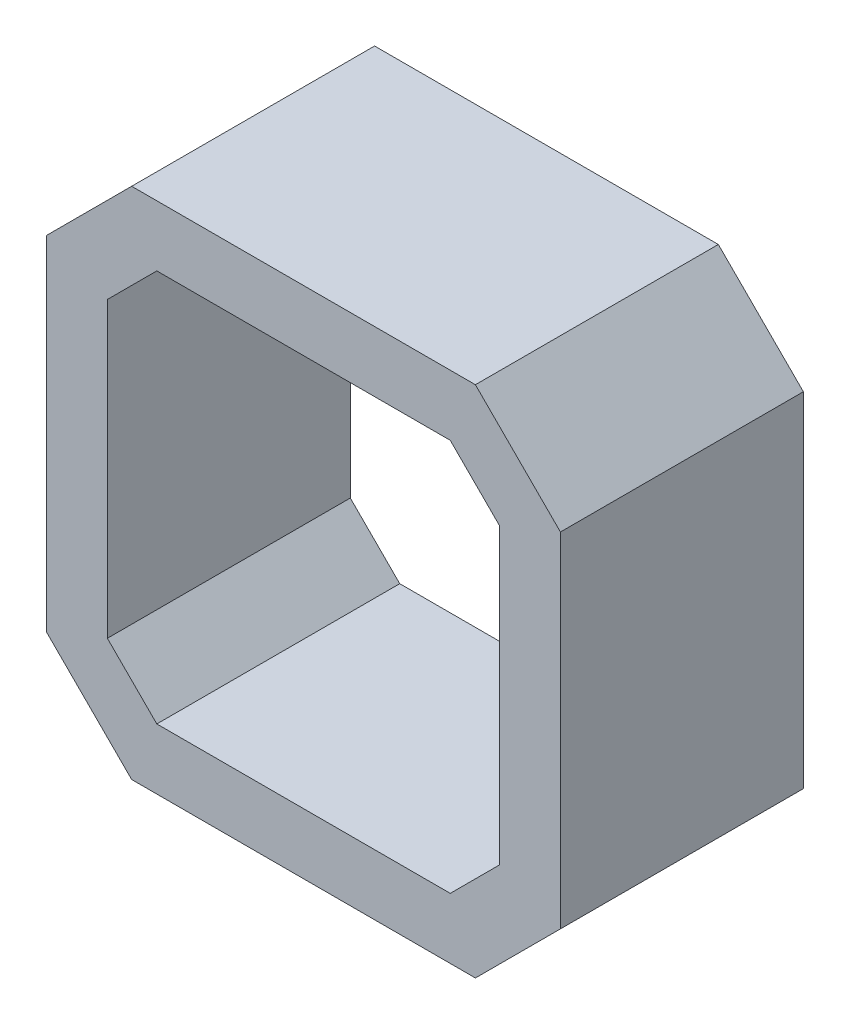
ISO-10303-21;
HEADER;
FILE_DESCRIPTION(('STEP AP214'),'2;1');
FILE_NAME('part.step','',(''),(''),'','','');
FILE_SCHEMA(('AUTOMOTIVE_DESIGN { 1 0 10303 214 1 1 1 1 }'));
ENDSEC;
DATA;
#1=APPLICATION_CONTEXT('core data for automotive mechanical design processes');
#2=APPLICATION_PROTOCOL_DEFINITION('international standard','automotive_design',2000,#1);
#3=PRODUCT_CONTEXT('',#1,'mechanical');
#4=PRODUCT('Part','Part','',(#3));
#5=PRODUCT_RELATED_PRODUCT_CATEGORY('part','',(#4));
#6=PRODUCT_DEFINITION_FORMATION('','',#4);
#7=PRODUCT_DEFINITION_CONTEXT('part definition',#1,'design');
#8=PRODUCT_DEFINITION('design','',#6,#7);
#9=PRODUCT_DEFINITION_SHAPE('','',#8);
#10=(LENGTH_UNIT() NAMED_UNIT(*) SI_UNIT(.MILLI.,.METRE.));
#11=(NAMED_UNIT(*) PLANE_ANGLE_UNIT() SI_UNIT($,.RADIAN.));
#12=(NAMED_UNIT(*) SI_UNIT($,.STERADIAN.) SOLID_ANGLE_UNIT());
#13=UNCERTAINTY_MEASURE_WITH_UNIT(LENGTH_MEASURE(1.E-05),#10,'distance_accuracy_value','');
#14=(GEOMETRIC_REPRESENTATION_CONTEXT(3) GLOBAL_UNCERTAINTY_ASSIGNED_CONTEXT((#13)) GLOBAL_UNIT_ASSIGNED_CONTEXT((#10,
#11,#12)) REPRESENTATION_CONTEXT('',''));
#15=CARTESIAN_POINT('',(0.,0.,0.));
#16=DIRECTION('',(0.,0.,1.));
#17=DIRECTION('',(1.,0.,0.));
#18=AXIS2_PLACEMENT_3D('',#15,#16,#17);
#19=CARTESIAN_POINT('',(0.,0.,20.));
#20=DIRECTION('',(0.,0.,-1.));
#21=DIRECTION('',(-1.,0.,0.));
#22=AXIS2_PLACEMENT_3D('',#19,#20,#21);
#23=PLANE('',#22);
#24=DIRECTION('',(0.,-1.,0.));
#25=VECTOR('',#24,1.);
#26=CARTESIAN_POINT('',(-21.15,-14.15,20.));
#27=LINE('',#26,#25);
#28=CARTESIAN_POINT('',(-21.15,14.15,20.));
#29=VERTEX_POINT('',#28);
#30=CARTESIAN_POINT('',(-21.15,-14.15,20.));
#31=VERTEX_POINT('',#30);
#32=EDGE_CURVE('E211',#29,#31,#27,.T.);
#33=ORIENTED_EDGE('',*,*,#32,.T.);
#34=DIRECTION('',(0.707106781186547,-0.707106781186547,0.));
#35=VECTOR('',#34,1.);
#36=CARTESIAN_POINT('',(-21.15,-14.15,20.));
#37=LINE('',#36,#35);
#38=CARTESIAN_POINT('',(-14.15,-21.15,20.));
#39=VERTEX_POINT('',#38);
#40=EDGE_CURVE('E214',#31,#39,#37,.T.);
#41=ORIENTED_EDGE('',*,*,#40,.T.);
#42=DIRECTION('',(1.,0.,0.));
#43=VECTOR('',#42,1.);
#44=CARTESIAN_POINT('',(-14.15,-21.15,20.));
#45=LINE('',#44,#43);
#46=CARTESIAN_POINT('',(14.15,-21.15,20.));
#47=VERTEX_POINT('',#46);
#48=EDGE_CURVE('E217',#39,#47,#45,.T.);
#49=ORIENTED_EDGE('',*,*,#48,.T.);
#50=DIRECTION('',(0.707106781186547,0.707106781186547,0.));
#51=VECTOR('',#50,1.);
#52=CARTESIAN_POINT('',(14.15,-21.15,20.));
#53=LINE('',#52,#51);
#54=CARTESIAN_POINT('',(21.15,-14.15,20.));
#55=VERTEX_POINT('',#54);
#56=EDGE_CURVE('E219',#47,#55,#53,.T.);
#57=ORIENTED_EDGE('',*,*,#56,.T.);
#58=DIRECTION('',(0.,1.,0.));
#59=VECTOR('',#58,1.);
#60=CARTESIAN_POINT('',(21.15,-14.15,20.));
#61=LINE('',#60,#59);
#62=CARTESIAN_POINT('',(21.15,14.15,20.));
#63=VERTEX_POINT('',#62);
#64=EDGE_CURVE('E221',#55,#63,#61,.T.);
#65=ORIENTED_EDGE('',*,*,#64,.T.);
#66=DIRECTION('',(-0.707106781186547,0.707106781186547,0.));
#67=VECTOR('',#66,1.);
#68=CARTESIAN_POINT('',(14.15,21.15,20.));
#69=LINE('',#68,#67);
#70=CARTESIAN_POINT('',(14.15,21.15,20.));
#71=VERTEX_POINT('',#70);
#72=EDGE_CURVE('E223',#63,#71,#69,.T.);
#73=ORIENTED_EDGE('',*,*,#72,.T.);
#74=DIRECTION('',(-1.,0.,0.));
#75=VECTOR('',#74,1.);
#76=CARTESIAN_POINT('',(-14.15,21.15,20.));
#77=LINE('',#76,#75);
#78=CARTESIAN_POINT('',(-14.15,21.15,20.));
#79=VERTEX_POINT('',#78);
#80=EDGE_CURVE('E225',#71,#79,#77,.T.);
#81=ORIENTED_EDGE('',*,*,#80,.T.);
#82=DIRECTION('',(-0.707106781186547,-0.707106781186547,0.));
#83=VECTOR('',#82,1.);
#84=CARTESIAN_POINT('',(-21.15,14.15,20.));
#85=LINE('',#84,#83);
#86=EDGE_CURVE('E227',#79,#29,#85,.T.);
#87=ORIENTED_EDGE('',*,*,#86,.T.);
#88=EDGE_LOOP('',(#33,#41,#49,#57,#65,#73,#81,#87));
#89=FACE_BOUND('',#88,.T.);
#90=DIRECTION('',(-0.707106781186547,-0.707106781186547,0.));
#91=VECTOR('',#90,1.);
#92=CARTESIAN_POINT('',(-16.15,12.0789321881345,20.));
#93=LINE('',#92,#91);
#94=CARTESIAN_POINT('',(-12.0789321881345,16.15,20.));
#95=VERTEX_POINT('',#94);
#96=CARTESIAN_POINT('',(-16.15,12.0789321881345,20.));
#97=VERTEX_POINT('',#96);
#98=EDGE_CURVE('E146',#95,#97,#93,.T.);
#99=ORIENTED_EDGE('',*,*,#98,.F.);
#100=DIRECTION('',(-1.,0.,0.));
#101=VECTOR('',#100,1.);
#102=CARTESIAN_POINT('',(-12.0789321881345,16.15,20.));
#103=LINE('',#102,#101);
#104=CARTESIAN_POINT('',(12.0789321881345,16.15,20.));
#105=VERTEX_POINT('',#104);
#106=EDGE_CURVE('E179',#105,#95,#103,.T.);
#107=ORIENTED_EDGE('',*,*,#106,.F.);
#108=DIRECTION('',(-0.707106781186547,0.707106781186547,0.));
#109=VECTOR('',#108,1.);
#110=CARTESIAN_POINT('',(12.0789321881345,16.15,20.));
#111=LINE('',#110,#109);
#112=CARTESIAN_POINT('',(16.15,12.0789321881345,20.));
#113=VERTEX_POINT('',#112);
#114=EDGE_CURVE('E177',#113,#105,#111,.T.);
#115=ORIENTED_EDGE('',*,*,#114,.F.);
#116=DIRECTION('',(0.,1.,0.));
#117=VECTOR('',#116,1.);
#118=CARTESIAN_POINT('',(16.15,-12.0789321881345,20.));
#119=LINE('',#118,#117);
#120=CARTESIAN_POINT('',(16.15,-12.0789321881345,20.));
#121=VERTEX_POINT('',#120);
#122=EDGE_CURVE('E175',#121,#113,#119,.T.);
#123=ORIENTED_EDGE('',*,*,#122,.F.);
#124=DIRECTION('',(0.707106781186547,0.707106781186547,0.));
#125=VECTOR('',#124,1.);
#126=CARTESIAN_POINT('',(12.0789321881345,-16.15,20.));
#127=LINE('',#126,#125);
#128=CARTESIAN_POINT('',(12.0789321881345,-16.15,20.));
#129=VERTEX_POINT('',#128);
#130=EDGE_CURVE('E173',#129,#121,#127,.T.);
#131=ORIENTED_EDGE('',*,*,#130,.F.);
#132=DIRECTION('',(1.,0.,0.));
#133=VECTOR('',#132,1.);
#134=CARTESIAN_POINT('',(-12.0789321881345,-16.15,20.));
#135=LINE('',#134,#133);
#136=CARTESIAN_POINT('',(-12.0789321881345,-16.15,20.));
#137=VERTEX_POINT('',#136);
#138=EDGE_CURVE('E169',#137,#129,#135,.T.);
#139=ORIENTED_EDGE('',*,*,#138,.F.);
#140=DIRECTION('',(0.707106781186547,-0.707106781186547,0.));
#141=VECTOR('',#140,1.);
#142=CARTESIAN_POINT('',(-16.15,-12.0789321881345,20.));
#143=LINE('',#142,#141);
#144=CARTESIAN_POINT('',(-16.15,-12.0789321881345,20.));
#145=VERTEX_POINT('',#144);
#146=EDGE_CURVE('E167',#145,#137,#143,.T.);
#147=ORIENTED_EDGE('',*,*,#146,.F.);
#148=DIRECTION('',(0.,-1.,0.));
#149=VECTOR('',#148,1.);
#150=CARTESIAN_POINT('',(-16.15,-12.0789321881345,20.));
#151=LINE('',#150,#149);
#152=EDGE_CURVE('E154',#97,#145,#151,.T.);
#153=ORIENTED_EDGE('',*,*,#152,.F.);
#154=EDGE_LOOP('',(#99,#107,#115,#123,#131,#139,#147,#153));
#155=FACE_BOUND('',#154,.T.);
#156=ADVANCED_FACE('F33',(#89,#155),#23,.F.);
#157=CARTESIAN_POINT('',(0.,0.,0.));
#158=DIRECTION('',(0.,0.,-1.));
#159=DIRECTION('',(-1.,0.,0.));
#160=AXIS2_PLACEMENT_3D('',#157,#158,#159);
#161=PLANE('',#160);
#162=DIRECTION('',(0.,-1.,0.));
#163=VECTOR('',#162,1.);
#164=CARTESIAN_POINT('',(-21.15,-14.15,0.));
#165=LINE('',#164,#163);
#166=CARTESIAN_POINT('',(-21.15,14.15,0.));
#167=VERTEX_POINT('',#166);
#168=CARTESIAN_POINT('',(-21.15,-14.15,0.));
#169=VERTEX_POINT('',#168);
#170=EDGE_CURVE('E162',#167,#169,#165,.T.);
#171=ORIENTED_EDGE('',*,*,#170,.F.);
#172=DIRECTION('',(-0.707106781186547,-0.707106781186547,0.));
#173=VECTOR('',#172,1.);
#174=CARTESIAN_POINT('',(-21.15,14.15,0.));
#175=LINE('',#174,#173);
#176=CARTESIAN_POINT('',(-14.15,21.15,0.));
#177=VERTEX_POINT('',#176);
#178=EDGE_CURVE('E215',#177,#167,#175,.T.);
#179=ORIENTED_EDGE('',*,*,#178,.F.);
#180=DIRECTION('',(-1.,0.,0.));
#181=VECTOR('',#180,1.);
#182=CARTESIAN_POINT('',(-14.15,21.15,0.));
#183=LINE('',#182,#181);
#184=CARTESIAN_POINT('',(14.15,21.15,0.));
#185=VERTEX_POINT('',#184);
#186=EDGE_CURVE('E242',#185,#177,#183,.T.);
#187=ORIENTED_EDGE('',*,*,#186,.F.);
#188=DIRECTION('',(-0.707106781186547,0.707106781186547,0.));
#189=VECTOR('',#188,1.);
#190=CARTESIAN_POINT('',(14.15,21.15,0.));
#191=LINE('',#190,#189);
#192=CARTESIAN_POINT('',(21.15,14.15,0.));
#193=VERTEX_POINT('',#192);
#194=EDGE_CURVE('E240',#193,#185,#191,.T.);
#195=ORIENTED_EDGE('',*,*,#194,.F.);
#196=DIRECTION('',(0.,1.,0.));
#197=VECTOR('',#196,1.);
#198=CARTESIAN_POINT('',(21.15,-14.15,0.));
#199=LINE('',#198,#197);
#200=CARTESIAN_POINT('',(21.15,-14.15,0.));
#201=VERTEX_POINT('',#200);
#202=EDGE_CURVE('E238',#201,#193,#199,.T.);
#203=ORIENTED_EDGE('',*,*,#202,.F.);
#204=DIRECTION('',(0.707106781186547,0.707106781186547,0.));
#205=VECTOR('',#204,1.);
#206=CARTESIAN_POINT('',(14.15,-21.15,0.));
#207=LINE('',#206,#205);
#208=CARTESIAN_POINT('',(14.15,-21.15,0.));
#209=VERTEX_POINT('',#208);
#210=EDGE_CURVE('E236',#209,#201,#207,.T.);
#211=ORIENTED_EDGE('',*,*,#210,.F.);
#212=DIRECTION('',(1.,0.,0.));
#213=VECTOR('',#212,1.);
#214=CARTESIAN_POINT('',(-14.15,-21.15,0.));
#215=LINE('',#214,#213);
#216=CARTESIAN_POINT('',(-14.15,-21.15,0.));
#217=VERTEX_POINT('',#216);
#218=EDGE_CURVE('E234',#217,#209,#215,.T.);
#219=ORIENTED_EDGE('',*,*,#218,.F.);
#220=DIRECTION('',(0.707106781186547,-0.707106781186547,0.));
#221=VECTOR('',#220,1.);
#222=CARTESIAN_POINT('',(-21.15,-14.15,0.));
#223=LINE('',#222,#221);
#224=EDGE_CURVE('E232',#169,#217,#223,.T.);
#225=ORIENTED_EDGE('',*,*,#224,.F.);
#226=EDGE_LOOP('',(#171,#179,#187,#195,#203,#211,#219,#225));
#227=FACE_BOUND('',#226,.T.);
#228=DIRECTION('',(-1.,0.,0.));
#229=VECTOR('',#228,1.);
#230=CARTESIAN_POINT('',(-12.0789321881345,16.15,0.));
#231=LINE('',#230,#229);
#232=CARTESIAN_POINT('',(12.0789321881345,16.15,0.));
#233=VERTEX_POINT('',#232);
#234=CARTESIAN_POINT('',(-12.0789321881345,16.15,0.));
#235=VERTEX_POINT('',#234);
#236=EDGE_CURVE('E155',#233,#235,#231,.T.);
#237=ORIENTED_EDGE('',*,*,#236,.T.);
#238=DIRECTION('',(-0.707106781186547,-0.707106781186547,0.));
#239=VECTOR('',#238,1.);
#240=CARTESIAN_POINT('',(-16.15,12.0789321881345,0.));
#241=LINE('',#240,#239);
#242=CARTESIAN_POINT('',(-16.15,12.0789321881345,0.));
#243=VERTEX_POINT('',#242);
#244=EDGE_CURVE('E56',#235,#243,#241,.T.);
#245=ORIENTED_EDGE('',*,*,#244,.T.);
#246=DIRECTION('',(0.,-1.,0.));
#247=VECTOR('',#246,1.);
#248=CARTESIAN_POINT('',(-16.15,-12.0789321881345,0.));
#249=LINE('',#248,#247);
#250=CARTESIAN_POINT('',(-16.15,-12.0789321881345,0.));
#251=VERTEX_POINT('',#250);
#252=EDGE_CURVE('E161',#243,#251,#249,.T.);
#253=ORIENTED_EDGE('',*,*,#252,.T.);
#254=DIRECTION('',(0.707106781186547,-0.707106781186547,0.));
#255=VECTOR('',#254,1.);
#256=CARTESIAN_POINT('',(-16.15,-12.0789321881345,0.));
#257=LINE('',#256,#255);
#258=CARTESIAN_POINT('',(-12.0789321881345,-16.15,0.));
#259=VERTEX_POINT('',#258);
#260=EDGE_CURVE('E183',#251,#259,#257,.T.);
#261=ORIENTED_EDGE('',*,*,#260,.T.);
#262=DIRECTION('',(1.,0.,0.));
#263=VECTOR('',#262,1.);
#264=CARTESIAN_POINT('',(-12.0789321881345,-16.15,0.));
#265=LINE('',#264,#263);
#266=CARTESIAN_POINT('',(12.0789321881345,-16.15,0.));
#267=VERTEX_POINT('',#266);
#268=EDGE_CURVE('E186',#259,#267,#265,.T.);
#269=ORIENTED_EDGE('',*,*,#268,.T.);
#270=DIRECTION('',(0.707106781186547,0.707106781186547,0.));
#271=VECTOR('',#270,1.);
#272=CARTESIAN_POINT('',(12.0789321881345,-16.15,0.));
#273=LINE('',#272,#271);
#274=CARTESIAN_POINT('',(16.15,-12.0789321881345,0.));
#275=VERTEX_POINT('',#274);
#276=EDGE_CURVE('E189',#267,#275,#273,.T.);
#277=ORIENTED_EDGE('',*,*,#276,.T.);
#278=DIRECTION('',(0.,1.,0.));
#279=VECTOR('',#278,1.);
#280=CARTESIAN_POINT('',(16.15,-12.0789321881345,0.));
#281=LINE('',#280,#279);
#282=CARTESIAN_POINT('',(16.15,12.0789321881345,0.));
#283=VERTEX_POINT('',#282);
#284=EDGE_CURVE('E192',#275,#283,#281,.T.);
#285=ORIENTED_EDGE('',*,*,#284,.T.);
#286=DIRECTION('',(-0.707106781186547,0.707106781186547,0.));
#287=VECTOR('',#286,1.);
#288=CARTESIAN_POINT('',(12.0789321881345,16.15,0.));
#289=LINE('',#288,#287);
#290=EDGE_CURVE('E195',#283,#233,#289,.T.);
#291=ORIENTED_EDGE('',*,*,#290,.T.);
#292=EDGE_LOOP('',(#237,#245,#253,#261,#269,#277,#285,#291));
#293=FACE_BOUND('',#292,.T.);
#294=ADVANCED_FACE('F272',(#227,#293),#161,.T.);
#295=CARTESIAN_POINT('',(-21.15,-14.15,20.));
#296=DIRECTION('',(1.,0.,0.));
#297=DIRECTION('',(0.,0.,-1.));
#298=AXIS2_PLACEMENT_3D('',#295,#296,#297);
#299=PLANE('',#298);
#300=ORIENTED_EDGE('',*,*,#170,.T.);
#301=DIRECTION('',(0.,0.,-1.));
#302=VECTOR('',#301,1.);
#303=CARTESIAN_POINT('',(-21.15,-14.15,20.));
#304=LINE('',#303,#302);
#305=EDGE_CURVE('E11',#31,#169,#304,.T.);
#306=ORIENTED_EDGE('',*,*,#305,.F.);
#307=ORIENTED_EDGE('',*,*,#32,.F.);
#308=DIRECTION('',(0.,0.,-1.));
#309=VECTOR('',#308,1.);
#310=CARTESIAN_POINT('',(-21.15,14.15,20.));
#311=LINE('',#310,#309);
#312=EDGE_CURVE('E229',#29,#167,#311,.T.);
#313=ORIENTED_EDGE('',*,*,#312,.T.);
#314=EDGE_LOOP('',(#300,#306,#307,#313));
#315=FACE_BOUND('',#314,.T.);
#316=ADVANCED_FACE('F35',(#315),#299,.F.);
#317=CARTESIAN_POINT('',(-21.15,-14.15,20.));
#318=DIRECTION('',(0.707106781186548,0.707106781186548,0.));
#319=DIRECTION('',(-0.707106781186548,0.707106781186548,0.));
#320=AXIS2_PLACEMENT_3D('',#317,#318,#319);
#321=PLANE('',#320);
#322=ORIENTED_EDGE('',*,*,#224,.T.);
#323=DIRECTION('',(0.,0.,-1.));
#324=VECTOR('',#323,1.);
#325=CARTESIAN_POINT('',(-14.15,-21.15,20.));
#326=LINE('',#325,#324);
#327=EDGE_CURVE('E41',#39,#217,#326,.T.);
#328=ORIENTED_EDGE('',*,*,#327,.F.);
#329=ORIENTED_EDGE('',*,*,#40,.F.);
#330=ORIENTED_EDGE('',*,*,#305,.T.);
#331=EDGE_LOOP('',(#322,#328,#329,#330));
#332=FACE_BOUND('',#331,.T.);
#333=ADVANCED_FACE('F289',(#332),#321,.F.);
#334=CARTESIAN_POINT('',(-14.15,-21.15,20.));
#335=DIRECTION('',(0.,1.,0.));
#336=DIRECTION('',(0.,0.,1.));
#337=AXIS2_PLACEMENT_3D('',#334,#335,#336);
#338=PLANE('',#337);
#339=ORIENTED_EDGE('',*,*,#218,.T.);
#340=DIRECTION('',(0.,0.,-1.));
#341=VECTOR('',#340,1.);
#342=CARTESIAN_POINT('',(14.15,-21.15,20.));
#343=LINE('',#342,#341);
#344=EDGE_CURVE('E259',#47,#209,#343,.T.);
#345=ORIENTED_EDGE('',*,*,#344,.F.);
#346=ORIENTED_EDGE('',*,*,#48,.F.);
#347=ORIENTED_EDGE('',*,*,#327,.T.);
#348=EDGE_LOOP('',(#339,#345,#346,#347));
#349=FACE_BOUND('',#348,.T.);
#350=ADVANCED_FACE('F266',(#349),#338,.F.);
#351=CARTESIAN_POINT('',(14.15,-21.15,20.));
#352=DIRECTION('',(-0.707106781186548,0.707106781186548,0.));
#353=DIRECTION('',(-0.707106781186548,-0.707106781186548,0.));
#354=AXIS2_PLACEMENT_3D('',#351,#352,#353);
#355=PLANE('',#354);
#356=ORIENTED_EDGE('',*,*,#210,.T.);
#357=DIRECTION('',(0.,0.,-1.));
#358=VECTOR('',#357,1.);
#359=CARTESIAN_POINT('',(21.15,-14.15,20.));
#360=LINE('',#359,#358);
#361=EDGE_CURVE('E256',#55,#201,#360,.T.);
#362=ORIENTED_EDGE('',*,*,#361,.F.);
#363=ORIENTED_EDGE('',*,*,#56,.F.);
#364=ORIENTED_EDGE('',*,*,#344,.T.);
#365=EDGE_LOOP('',(#356,#362,#363,#364));
#366=FACE_BOUND('',#365,.T.);
#367=ADVANCED_FACE('F278',(#366),#355,.F.);
#368=CARTESIAN_POINT('',(21.15,-14.15,20.));
#369=DIRECTION('',(-1.,0.,0.));
#370=DIRECTION('',(0.,0.,1.));
#371=AXIS2_PLACEMENT_3D('',#368,#369,#370);
#372=PLANE('',#371);
#373=ORIENTED_EDGE('',*,*,#202,.T.);
#374=DIRECTION('',(0.,0.,-1.));
#375=VECTOR('',#374,1.);
#376=CARTESIAN_POINT('',(21.15,14.15,20.));
#377=LINE('',#376,#375);
#378=EDGE_CURVE('E253',#63,#193,#377,.T.);
#379=ORIENTED_EDGE('',*,*,#378,.F.);
#380=ORIENTED_EDGE('',*,*,#64,.F.);
#381=ORIENTED_EDGE('',*,*,#361,.T.);
#382=EDGE_LOOP('',(#373,#379,#380,#381));
#383=FACE_BOUND('',#382,.T.);
#384=ADVANCED_FACE('F282',(#383),#372,.F.);
#385=CARTESIAN_POINT('',(14.15,21.15,20.));
#386=DIRECTION('',(-0.707106781186548,-0.707106781186548,0.));
#387=DIRECTION('',(0.707106781186548,-0.707106781186548,0.));
#388=AXIS2_PLACEMENT_3D('',#385,#386,#387);
#389=PLANE('',#388);
#390=ORIENTED_EDGE('',*,*,#194,.T.);
#391=DIRECTION('',(0.,0.,-1.));
#392=VECTOR('',#391,1.);
#393=CARTESIAN_POINT('',(14.15,21.15,20.));
#394=LINE('',#393,#392);
#395=EDGE_CURVE('E250',#71,#185,#394,.T.);
#396=ORIENTED_EDGE('',*,*,#395,.F.);
#397=ORIENTED_EDGE('',*,*,#72,.F.);
#398=ORIENTED_EDGE('',*,*,#378,.T.);
#399=EDGE_LOOP('',(#390,#396,#397,#398));
#400=FACE_BOUND('',#399,.T.);
#401=ADVANCED_FACE('F302',(#400),#389,.F.);
#402=CARTESIAN_POINT('',(-14.15,21.15,20.));
#403=DIRECTION('',(0.,-1.,0.));
#404=DIRECTION('',(0.,0.,-1.));
#405=AXIS2_PLACEMENT_3D('',#402,#403,#404);
#406=PLANE('',#405);
#407=ORIENTED_EDGE('',*,*,#186,.T.);
#408=DIRECTION('',(0.,0.,-1.));
#409=VECTOR('',#408,1.);
#410=CARTESIAN_POINT('',(-14.15,21.15,20.));
#411=LINE('',#410,#409);
#412=EDGE_CURVE('E247',#79,#177,#411,.T.);
#413=ORIENTED_EDGE('',*,*,#412,.F.);
#414=ORIENTED_EDGE('',*,*,#80,.F.);
#415=ORIENTED_EDGE('',*,*,#395,.T.);
#416=EDGE_LOOP('',(#407,#413,#414,#415));
#417=FACE_BOUND('',#416,.T.);
#418=ADVANCED_FACE('F300',(#417),#406,.F.);
#419=CARTESIAN_POINT('',(-21.15,14.15,20.));
#420=DIRECTION('',(0.707106781186548,-0.707106781186548,0.));
#421=DIRECTION('',(0.707106781186548,0.707106781186548,0.));
#422=AXIS2_PLACEMENT_3D('',#419,#420,#421);
#423=PLANE('',#422);
#424=ORIENTED_EDGE('',*,*,#178,.T.);
#425=ORIENTED_EDGE('',*,*,#312,.F.);
#426=ORIENTED_EDGE('',*,*,#86,.F.);
#427=ORIENTED_EDGE('',*,*,#412,.T.);
#428=EDGE_LOOP('',(#424,#425,#426,#427));
#429=FACE_BOUND('',#428,.T.);
#430=ADVANCED_FACE('F295',(#429),#423,.F.);
#431=CARTESIAN_POINT('',(-16.15,12.0789321881345,20.));
#432=DIRECTION('',(0.707106781186548,-0.707106781186548,0.));
#433=DIRECTION('',(0.707106781186548,0.707106781186548,0.));
#434=AXIS2_PLACEMENT_3D('',#431,#432,#433);
#435=PLANE('',#434);
#436=ORIENTED_EDGE('',*,*,#244,.F.);
#437=DIRECTION('',(0.,0.,-1.));
#438=VECTOR('',#437,1.);
#439=CARTESIAN_POINT('',(-12.0789321881345,16.15,20.));
#440=LINE('',#439,#438);
#441=EDGE_CURVE('E150',#95,#235,#440,.T.);
#442=ORIENTED_EDGE('',*,*,#441,.F.);
#443=ORIENTED_EDGE('',*,*,#98,.T.);
#444=DIRECTION('',(0.,0.,-1.));
#445=VECTOR('',#444,1.);
#446=CARTESIAN_POINT('',(-16.15,12.0789321881345,20.));
#447=LINE('',#446,#445);
#448=EDGE_CURVE('E149',#97,#243,#447,.T.);
#449=ORIENTED_EDGE('',*,*,#448,.T.);
#450=EDGE_LOOP('',(#436,#442,#443,#449));
#451=FACE_BOUND('',#450,.T.);
#452=ADVANCED_FACE('F148',(#451),#435,.T.);
#453=CARTESIAN_POINT('',(-16.15,-12.0789321881345,20.));
#454=DIRECTION('',(1.,0.,0.));
#455=DIRECTION('',(0.,0.,-1.));
#456=AXIS2_PLACEMENT_3D('',#453,#454,#455);
#457=PLANE('',#456);
#458=ORIENTED_EDGE('',*,*,#252,.F.);
#459=ORIENTED_EDGE('',*,*,#448,.F.);
#460=ORIENTED_EDGE('',*,*,#152,.T.);
#461=DIRECTION('',(0.,0.,-1.));
#462=VECTOR('',#461,1.);
#463=CARTESIAN_POINT('',(-16.15,-12.0789321881345,20.));
#464=LINE('',#463,#462);
#465=EDGE_CURVE('E163',#145,#251,#464,.T.);
#466=ORIENTED_EDGE('',*,*,#465,.T.);
#467=EDGE_LOOP('',(#458,#459,#460,#466));
#468=FACE_BOUND('',#467,.T.);
#469=ADVANCED_FACE('F158',(#468),#457,.T.);
#470=CARTESIAN_POINT('',(-16.15,-12.0789321881345,20.));
#471=DIRECTION('',(0.707106781186548,0.707106781186548,0.));
#472=DIRECTION('',(-0.707106781186548,0.707106781186548,0.));
#473=AXIS2_PLACEMENT_3D('',#470,#471,#472);
#474=PLANE('',#473);
#475=ORIENTED_EDGE('',*,*,#260,.F.);
#476=ORIENTED_EDGE('',*,*,#465,.F.);
#477=ORIENTED_EDGE('',*,*,#146,.T.);
#478=DIRECTION('',(0.,0.,-1.));
#479=VECTOR('',#478,1.);
#480=CARTESIAN_POINT('',(-12.0789321881345,-16.15,20.));
#481=LINE('',#480,#479);
#482=EDGE_CURVE('E208',#137,#259,#481,.T.);
#483=ORIENTED_EDGE('',*,*,#482,.T.);
#484=EDGE_LOOP('',(#475,#476,#477,#483));
#485=FACE_BOUND('',#484,.T.);
#486=ADVANCED_FACE('F327',(#485),#474,.T.);
#487=CARTESIAN_POINT('',(-12.0789321881345,-16.15,20.));
#488=DIRECTION('',(0.,1.,0.));
#489=DIRECTION('',(0.,0.,1.));
#490=AXIS2_PLACEMENT_3D('',#487,#488,#489);
#491=PLANE('',#490);
#492=ORIENTED_EDGE('',*,*,#268,.F.);
#493=ORIENTED_EDGE('',*,*,#482,.F.);
#494=ORIENTED_EDGE('',*,*,#138,.T.);
#495=DIRECTION('',(0.,0.,-1.));
#496=VECTOR('',#495,1.);
#497=CARTESIAN_POINT('',(12.0789321881345,-16.15,20.));
#498=LINE('',#497,#496);
#499=EDGE_CURVE('E206',#129,#267,#498,.T.);
#500=ORIENTED_EDGE('',*,*,#499,.T.);
#501=EDGE_LOOP('',(#492,#493,#494,#500));
#502=FACE_BOUND('',#501,.T.);
#503=ADVANCED_FACE('F331',(#502),#491,.T.);
#504=CARTESIAN_POINT('',(12.0789321881345,-16.15,20.));
#505=DIRECTION('',(-0.707106781186548,0.707106781186548,0.));
#506=DIRECTION('',(-0.707106781186548,-0.707106781186548,0.));
#507=AXIS2_PLACEMENT_3D('',#504,#505,#506);
#508=PLANE('',#507);
#509=ORIENTED_EDGE('',*,*,#276,.F.);
#510=ORIENTED_EDGE('',*,*,#499,.F.);
#511=ORIENTED_EDGE('',*,*,#130,.T.);
#512=DIRECTION('',(0.,0.,-1.));
#513=VECTOR('',#512,1.);
#514=CARTESIAN_POINT('',(16.15,-12.0789321881345,20.));
#515=LINE('',#514,#513);
#516=EDGE_CURVE('E204',#121,#275,#515,.T.);
#517=ORIENTED_EDGE('',*,*,#516,.T.);
#518=EDGE_LOOP('',(#509,#510,#511,#517));
#519=FACE_BOUND('',#518,.T.);
#520=ADVANCED_FACE('F337',(#519),#508,.T.);
#521=CARTESIAN_POINT('',(16.15,-12.0789321881345,20.));
#522=DIRECTION('',(-1.,0.,0.));
#523=DIRECTION('',(0.,0.,1.));
#524=AXIS2_PLACEMENT_3D('',#521,#522,#523);
#525=PLANE('',#524);
#526=ORIENTED_EDGE('',*,*,#284,.F.);
#527=ORIENTED_EDGE('',*,*,#516,.F.);
#528=ORIENTED_EDGE('',*,*,#122,.T.);
#529=DIRECTION('',(0.,0.,-1.));
#530=VECTOR('',#529,1.);
#531=CARTESIAN_POINT('',(16.15,12.0789321881345,20.));
#532=LINE('',#531,#530);
#533=EDGE_CURVE('E202',#113,#283,#532,.T.);
#534=ORIENTED_EDGE('',*,*,#533,.T.);
#535=EDGE_LOOP('',(#526,#527,#528,#534));
#536=FACE_BOUND('',#535,.T.);
#537=ADVANCED_FACE('F341',(#536),#525,.T.);
#538=CARTESIAN_POINT('',(12.0789321881345,16.15,20.));
#539=DIRECTION('',(-0.707106781186548,-0.707106781186548,0.));
#540=DIRECTION('',(0.707106781186548,-0.707106781186548,0.));
#541=AXIS2_PLACEMENT_3D('',#538,#539,#540);
#542=PLANE('',#541);
#543=ORIENTED_EDGE('',*,*,#290,.F.);
#544=ORIENTED_EDGE('',*,*,#533,.F.);
#545=ORIENTED_EDGE('',*,*,#114,.T.);
#546=DIRECTION('',(0.,0.,-1.));
#547=VECTOR('',#546,1.);
#548=CARTESIAN_POINT('',(12.0789321881345,16.15,20.));
#549=LINE('',#548,#547);
#550=EDGE_CURVE('E48',#105,#233,#549,.T.);
#551=ORIENTED_EDGE('',*,*,#550,.T.);
#552=EDGE_LOOP('',(#543,#544,#545,#551));
#553=FACE_BOUND('',#552,.T.);
#554=ADVANCED_FACE('F345',(#553),#542,.T.);
#555=CARTESIAN_POINT('',(-12.0789321881345,16.15,20.));
#556=DIRECTION('',(0.,-1.,0.));
#557=DIRECTION('',(0.,0.,-1.));
#558=AXIS2_PLACEMENT_3D('',#555,#556,#557);
#559=PLANE('',#558);
#560=ORIENTED_EDGE('',*,*,#236,.F.);
#561=ORIENTED_EDGE('',*,*,#550,.F.);
#562=ORIENTED_EDGE('',*,*,#106,.T.);
#563=ORIENTED_EDGE('',*,*,#441,.T.);
#564=EDGE_LOOP('',(#560,#561,#562,#563));
#565=FACE_BOUND('',#564,.T.);
#566=ADVANCED_FACE('F349',(#565),#559,.T.);
#567=CLOSED_SHELL('',(#156,#294,#316,#333,#350,#367,#384,#401,#418,#430,#452,#469,#486,#503,
#520,#537,#554,#566));
#568=MANIFOLD_SOLID_BREP('B2',#567);
#569=ADVANCED_BREP_SHAPE_REPRESENTATION('',(#18,#568),#14);
#570=SHAPE_DEFINITION_REPRESENTATION(#9,#569);
ENDSEC;
END-ISO-10303-21;
